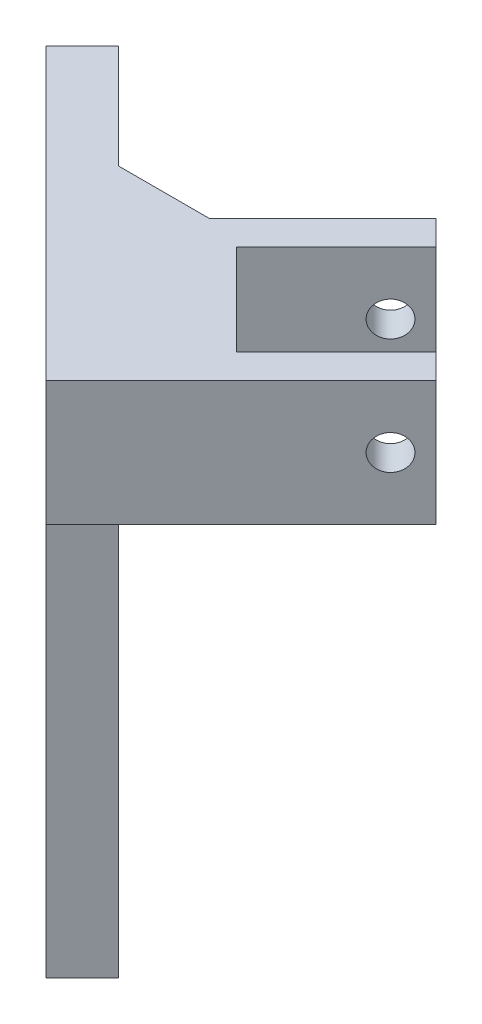
ISO-10303-21;
HEADER;
FILE_DESCRIPTION(('STEP AP214'),'2;1');
FILE_NAME('part.step','',(''),(''),'','','');
FILE_SCHEMA(('AUTOMOTIVE_DESIGN { 1 0 10303 214 1 1 1 1 }'));
ENDSEC;
DATA;
#1=APPLICATION_CONTEXT('core data for automotive mechanical design processes');
#2=APPLICATION_PROTOCOL_DEFINITION('international standard','automotive_design',2000,#1);
#3=PRODUCT_CONTEXT('',#1,'mechanical');
#4=PRODUCT('Part','Part','',(#3));
#5=PRODUCT_RELATED_PRODUCT_CATEGORY('part','',(#4));
#6=PRODUCT_DEFINITION_FORMATION('','',#4);
#7=PRODUCT_DEFINITION_CONTEXT('part definition',#1,'design');
#8=PRODUCT_DEFINITION('design','',#6,#7);
#9=PRODUCT_DEFINITION_SHAPE('','',#8);
#10=(LENGTH_UNIT() NAMED_UNIT(*) SI_UNIT(.MILLI.,.METRE.));
#11=(NAMED_UNIT(*) PLANE_ANGLE_UNIT() SI_UNIT($,.RADIAN.));
#12=(NAMED_UNIT(*) SI_UNIT($,.STERADIAN.) SOLID_ANGLE_UNIT());
#13=UNCERTAINTY_MEASURE_WITH_UNIT(LENGTH_MEASURE(1.E-05),#10,'distance_accuracy_value','');
#14=(GEOMETRIC_REPRESENTATION_CONTEXT(3) GLOBAL_UNCERTAINTY_ASSIGNED_CONTEXT((#13)) GLOBAL_UNIT_ASSIGNED_CONTEXT((#10,
#11,#12)) REPRESENTATION_CONTEXT('',''));
#15=CARTESIAN_POINT('',(0.,0.,0.));
#16=DIRECTION('',(0.,0.,1.));
#17=DIRECTION('',(1.,0.,0.));
#18=AXIS2_PLACEMENT_3D('',#15,#16,#17);
#19=CARTESIAN_POINT('',(48.0573202068203,32.8244024825225,-13.0970087257306));
#20=DIRECTION('',(0.,1.,0.));
#21=DIRECTION('',(0.,0.,1.));
#22=AXIS2_PLACEMENT_3D('',#19,#20,#21);
#23=PLANE('',#22);
#24=DIRECTION('',(0.707106781186548,0.,-0.707106781186548));
#25=VECTOR('',#24,1.);
#26=CARTESIAN_POINT('',(39.2026164109848,32.8244024825225,-21.9517125215661));
#27=LINE('',#26,#25);
#28=CARTESIAN_POINT('',(54.0518588159023,32.8244024825225,-36.8009549264837));
#29=VERTEX_POINT('',#28);
#30=CARTESIAN_POINT('',(69.6082080020064,32.8244024825225,-52.3573041125877));
#31=VERTEX_POINT('',#30);
#32=EDGE_CURVE('E306',#29,#31,#27,.T.);
#33=ORIENTED_EDGE('',*,*,#32,.F.);
#34=DIRECTION('',(-0.707106781186546,0.,-0.707106781186549));
#35=VECTOR('',#34,1.);
#36=CARTESIAN_POINT('',(62.9065626117379,32.8244024825225,-27.9462511306482));
#37=LINE('',#36,#35);
#38=CARTESIAN_POINT('',(68.1939944396333,32.8244024825225,-22.6588193027527));
#39=VERTEX_POINT('',#38);
#40=EDGE_CURVE('E308',#39,#29,#37,.T.);
#41=ORIENTED_EDGE('',*,*,#40,.F.);
#42=DIRECTION('',(-0.707106781186548,0.,0.707106781186547));
#43=VECTOR('',#42,1.);
#44=CARTESIAN_POINT('',(53.3447520347157,32.8244024825225,-7.8095768978352));
#45=LINE('',#44,#43);
#46=CARTESIAN_POINT('',(83.7503436257373,32.8244024825225,-38.2151684888568));
#47=VERTEX_POINT('',#46);
#48=EDGE_CURVE('E303',#47,#39,#45,.T.);
#49=ORIENTED_EDGE('',*,*,#48,.F.);
#50=DIRECTION('',(-0.707106781186547,0.,-0.707106781186548));
#51=VECTOR('',#50,1.);
#52=CARTESIAN_POINT('',(87.6464094306317,32.8244024825225,-34.3191026839623));
#53=LINE('',#52,#51);
#54=CARTESIAN_POINT('',(87.6464094306317,32.8244024825225,-34.3191026839623));
#55=VERTEX_POINT('',#54);
#56=EDGE_CURVE('E322',#55,#47,#53,.T.);
#57=ORIENTED_EDGE('',*,*,#56,.F.);
#58=DIRECTION('',(0.707106781186548,0.,-0.707106781186547));
#59=VECTOR('',#58,1.);
#60=CARTESIAN_POINT('',(57.2408178396102,32.8244024825225,-3.91351109294075));
#61=LINE('',#60,#59);
#62=CARTESIAN_POINT('',(57.2408178396102,32.8244024825225,-3.91351109294075));
#63=VERTEX_POINT('',#62);
#64=EDGE_CURVE('E394',#63,#55,#61,.T.);
#65=ORIENTED_EDGE('',*,*,#64,.F.);
#66=DIRECTION('',(0.707106781186548,0.,0.707106781186547));
#67=VECTOR('',#66,1.);
#68=CARTESIAN_POINT('',(48.0573202068203,32.8244024825225,-13.0970087257306));
#69=LINE('',#68,#67);
#70=CARTESIAN_POINT('',(48.0573202068203,32.8244024825225,-13.0970087257306));
#71=VERTEX_POINT('',#70);
#72=EDGE_CURVE('E348',#71,#63,#69,.T.);
#73=ORIENTED_EDGE('',*,*,#72,.F.);
#74=DIRECTION('',(0.707106781186548,0.,-0.707106781186547));
#75=VECTOR('',#74,1.);
#76=CARTESIAN_POINT('',(48.0573202068203,32.8244024825225,-13.0970087257306));
#77=LINE('',#76,#75);
#78=CARTESIAN_POINT('',(53.7141744563127,32.8244024825225,-18.7538629752231));
#79=VERTEX_POINT('',#78);
#80=EDGE_CURVE('E396',#71,#79,#77,.T.);
#81=ORIENTED_EDGE('',*,*,#80,.T.);
#82=DIRECTION('',(0.707106781186547,0.,0.707106781186548));
#83=VECTOR('',#82,1.);
#84=CARTESIAN_POINT('',(36.2340187157679,32.8244024825225,-36.2340187157678));
#85=LINE('',#84,#83);
#86=CARTESIAN_POINT('',(45.4175163485578,32.8244024825225,-27.050521082978));
#87=VERTEX_POINT('',#86);
#88=EDGE_CURVE('E412',#87,#79,#85,.T.);
#89=ORIENTED_EDGE('',*,*,#88,.F.);
#90=DIRECTION('',(0.707106781186548,0.,-0.707106781186547));
#91=VECTOR('',#90,1.);
#92=CARTESIAN_POINT('',(39.7606620990653,32.8244024825225,-21.3936668334856));
#93=LINE('',#92,#91);
#94=CARTESIAN_POINT('',(39.7606620990653,32.8244024825225,-21.3936668334856));
#95=VERTEX_POINT('',#94);
#96=EDGE_CURVE('E405',#95,#87,#93,.T.);
#97=ORIENTED_EDGE('',*,*,#96,.F.);
#98=DIRECTION('',(0.707106781186547,0.,0.707106781186548));
#99=VECTOR('',#98,1.);
#100=CARTESIAN_POINT('',(30.5771644662755,32.8244024825225,-30.5771644662755));
#101=LINE('',#100,#99);
#102=CARTESIAN_POINT('',(30.5771644662755,32.8244024825225,-30.5771644662755));
#103=VERTEX_POINT('',#102);
#104=EDGE_CURVE('E340',#103,#95,#101,.T.);
#105=ORIENTED_EDGE('',*,*,#104,.F.);
#106=DIRECTION('',(0.707106781186548,0.,-0.707106781186547));
#107=VECTOR('',#106,1.);
#108=CARTESIAN_POINT('',(30.5771644662755,32.8244024825225,-30.5771644662755));
#109=LINE('',#108,#107);
#110=CARTESIAN_POINT('',(38.5757003878185,32.8244024825225,-38.5757003878185));
#111=VERTEX_POINT('',#110);
#112=EDGE_CURVE('E50',#103,#111,#109,.T.);
#113=ORIENTED_EDGE('',*,*,#112,.T.);
#114=DIRECTION('',(1.,0.,0.));
#115=VECTOR('',#114,1.);
#116=CARTESIAN_POINT('',(48.0573202068202,32.8244024825225,-38.5757003878185));
#117=LINE('',#116,#115);
#118=CARTESIAN_POINT('',(48.0344726674483,32.8244024825225,-38.5757003878185));
#119=VERTEX_POINT('',#118);
#120=EDGE_CURVE('E11',#111,#119,#117,.T.);
#121=ORIENTED_EDGE('',*,*,#120,.T.);
#122=DIRECTION('',(-0.707106781186548,0.,0.707106781186548));
#123=VECTOR('',#122,1.);
#124=CARTESIAN_POINT('',(65.7121421971119,32.8244024825225,-56.2533699174822));
#125=LINE('',#124,#123);
#126=CARTESIAN_POINT('',(65.7121421971119,32.8244024825225,-56.2533699174822));
#127=VERTEX_POINT('',#126);
#128=EDGE_CURVE('E330',#127,#119,#125,.T.);
#129=ORIENTED_EDGE('',*,*,#128,.F.);
#130=EDGE_CURVE('E321',#31,#127,#53,.T.);
#131=ORIENTED_EDGE('',*,*,#130,.F.);
#132=EDGE_LOOP('',(#33,#41,#49,#57,#65,#73,#81,#89,#97,#105,#113,#121,#129,#131));
#133=FACE_BOUND('',#132,.T.);
#134=ADVANCED_FACE('F35',(#133),#23,.F.);
#135=CARTESIAN_POINT('',(12.0048651078897,52.2462761201849,-49.1494638246612));
#136=DIRECTION('',(0.,-1.,0.));
#137=DIRECTION('',(0.,0.,-1.));
#138=AXIS2_PLACEMENT_3D('',#135,#136,#137);
#139=PLANE('',#138);
#140=DIRECTION('',(0.707106781186548,0.,-0.707106781186548));
#141=VECTOR('',#140,1.);
#142=CARTESIAN_POINT('',(54.0518588159023,52.2462761201849,-36.8009549264837));
#143=LINE('',#142,#141);
#144=CARTESIAN_POINT('',(54.0518588159023,52.2462761201849,-36.8009549264837));
#145=VERTEX_POINT('',#144);
#146=CARTESIAN_POINT('',(69.6082080020064,52.2462761201849,-52.3573041125877));
#147=VERTEX_POINT('',#146);
#148=EDGE_CURVE('E287',#145,#147,#143,.T.);
#149=ORIENTED_EDGE('',*,*,#148,.T.);
#150=DIRECTION('',(0.707106781186548,0.,0.707106781186548));
#151=VECTOR('',#150,1.);
#152=CARTESIAN_POINT('',(65.7121421971119,52.246276120185,-56.2533699174822));
#153=LINE('',#152,#151);
#154=CARTESIAN_POINT('',(65.7121421971119,52.246276120185,-56.2533699174822));
#155=VERTEX_POINT('',#154);
#156=EDGE_CURVE('E314',#155,#147,#153,.T.);
#157=ORIENTED_EDGE('',*,*,#156,.F.);
#158=DIRECTION('',(-0.707106781186548,0.,0.707106781186548));
#159=VECTOR('',#158,1.);
#160=CARTESIAN_POINT('',(65.7121421971119,52.246276120185,-56.2533699174822));
#161=LINE('',#160,#159);
#162=CARTESIAN_POINT('',(48.0344726674483,52.246276120185,-38.5757003878185));
#163=VERTEX_POINT('',#162);
#164=EDGE_CURVE('E327',#155,#163,#161,.T.);
#165=ORIENTED_EDGE('',*,*,#164,.T.);
#166=DIRECTION('',(-1.,0.,0.));
#167=VECTOR('',#166,1.);
#168=CARTESIAN_POINT('',(12.0048651078898,52.2462761201849,-38.5757003878184));
#169=LINE('',#168,#167);
#170=CARTESIAN_POINT('',(33.8923370437172,52.2462761201849,-38.5757003878185));
#171=VERTEX_POINT('',#170);
#172=EDGE_CURVE('E424',#163,#171,#169,.T.);
#173=ORIENTED_EDGE('',*,*,#172,.T.);
#174=DIRECTION('',(-0.707106781186547,0.,-0.707106781186548));
#175=VECTOR('',#174,1.);
#176=CARTESIAN_POINT('',(17.6617193573821,52.2462761201849,-54.8063180741536));
#177=LINE('',#176,#175);
#178=CARTESIAN_POINT('',(17.6617193573821,52.2462761201849,-54.8063180741536));
#179=VERTEX_POINT('',#178);
#180=EDGE_CURVE('E372',#171,#179,#177,.T.);
#181=ORIENTED_EDGE('',*,*,#180,.T.);
#182=DIRECTION('',(0.707106781186548,0.,-0.707106781186547));
#183=VECTOR('',#182,1.);
#184=CARTESIAN_POINT('',(12.0048651078897,52.2462761201849,-49.1494638246612));
#185=LINE('',#184,#183);
#186=CARTESIAN_POINT('',(12.0048651078897,52.2462761201849,-49.1494638246612));
#187=VERTEX_POINT('',#186);
#188=EDGE_CURVE('E388',#187,#179,#185,.T.);
#189=ORIENTED_EDGE('',*,*,#188,.F.);
#190=DIRECTION('',(-0.707106781186547,0.,-0.707106781186548));
#191=VECTOR('',#190,1.);
#192=CARTESIAN_POINT('',(12.0048651078897,52.2462761201849,-49.1494638246612));
#193=LINE('',#192,#191);
#194=CARTESIAN_POINT('',(57.2408178396102,52.2462761201849,-3.91351109294075));
#195=VERTEX_POINT('',#194);
#196=EDGE_CURVE('E352',#195,#187,#193,.T.);
#197=ORIENTED_EDGE('',*,*,#196,.F.);
#198=DIRECTION('',(0.707106781186548,0.,-0.707106781186547));
#199=VECTOR('',#198,1.);
#200=CARTESIAN_POINT('',(57.2408178396102,52.2462761201849,-3.91351109294075));
#201=LINE('',#200,#199);
#202=CARTESIAN_POINT('',(87.6464094306318,52.2462761201849,-34.3191026839623));
#203=VERTEX_POINT('',#202);
#204=EDGE_CURVE('E391',#195,#203,#201,.T.);
#205=ORIENTED_EDGE('',*,*,#204,.T.);
#206=CARTESIAN_POINT('',(83.7503436257373,52.2462761201849,-38.2151684888568));
#207=VERTEX_POINT('',#206);
#208=EDGE_CURVE('E318',#207,#203,#153,.T.);
#209=ORIENTED_EDGE('',*,*,#208,.F.);
#210=DIRECTION('',(-0.707106781186548,0.,0.707106781186547));
#211=VECTOR('',#210,1.);
#212=CARTESIAN_POINT('',(83.7503436257373,52.2462761201849,-38.2151684888568));
#213=LINE('',#212,#211);
#214=CARTESIAN_POINT('',(68.1939944396333,52.2462761201849,-22.6588193027527));
#215=VERTEX_POINT('',#214);
#216=EDGE_CURVE('E290',#207,#215,#213,.T.);
#217=ORIENTED_EDGE('',*,*,#216,.T.);
#218=DIRECTION('',(-0.707106781186546,0.,-0.707106781186549));
#219=VECTOR('',#218,1.);
#220=CARTESIAN_POINT('',(68.1939944396333,52.2462761201849,-22.6588193027527));
#221=LINE('',#220,#219);
#222=EDGE_CURVE('E284',#215,#145,#221,.T.);
#223=ORIENTED_EDGE('',*,*,#222,.T.);
#224=EDGE_LOOP('',(#149,#157,#165,#173,#181,#189,#197,#205,#209,#217,#223));
#225=FACE_BOUND('',#224,.T.);
#226=ADVANCED_FACE('F505',(#225),#139,.F.);
#227=CARTESIAN_POINT('',(60.982756057297,0.,-60.982756057297));
#228=DIRECTION('',(0.707106781186548,0.,-0.707106781186548));
#229=DIRECTION('',(-0.707106781186548,0.,-0.707106781186548));
#230=AXIS2_PLACEMENT_3D('',#227,#228,#229);
#231=PLANE('',#230);
#232=ORIENTED_EDGE('',*,*,#156,.T.);
#233=DIRECTION('',(0.,1.,0.));
#234=VECTOR('',#233,1.);
#235=CARTESIAN_POINT('',(69.6082080020064,27.2462761201849,-52.3573041125877));
#236=LINE('',#235,#234);
#237=EDGE_CURVE('E298',#31,#147,#236,.T.);
#238=ORIENTED_EDGE('',*,*,#237,.F.);
#239=ORIENTED_EDGE('',*,*,#130,.T.);
#240=DIRECTION('',(0.,1.,0.));
#241=VECTOR('',#240,1.);
#242=CARTESIAN_POINT('',(65.7121421971119,32.8244024825225,-56.2533699174822));
#243=LINE('',#242,#241);
#244=EDGE_CURVE('E325',#127,#155,#243,.T.);
#245=ORIENTED_EDGE('',*,*,#244,.T.);
#246=EDGE_LOOP('',(#232,#238,#239,#245));
#247=FACE_BOUND('',#246,.T.);
#248=ADVANCED_FACE('F440',(#247),#231,.T.);
#249=ORIENTED_EDGE('',*,*,#56,.T.);
#250=DIRECTION('',(0.,1.,0.));
#251=VECTOR('',#250,1.);
#252=CARTESIAN_POINT('',(83.7503436257373,27.2462761201849,-38.2151684888568));
#253=LINE('',#252,#251);
#254=EDGE_CURVE('E295',#47,#207,#253,.T.);
#255=ORIENTED_EDGE('',*,*,#254,.T.);
#256=ORIENTED_EDGE('',*,*,#208,.T.);
#257=DIRECTION('',(0.,-1.,0.));
#258=VECTOR('',#257,1.);
#259=CARTESIAN_POINT('',(87.6464094306318,52.2462761201849,-34.3191026839623));
#260=LINE('',#259,#258);
#261=EDGE_CURVE('E317',#203,#55,#260,.T.);
#262=ORIENTED_EDGE('',*,*,#261,.T.);
#263=EDGE_LOOP('',(#249,#255,#256,#262));
#264=FACE_BOUND('',#263,.T.);
#265=ADVANCED_FACE('F457',(#264),#231,.T.);
#266=CARTESIAN_POINT('',(52.2910703713043,42.5353393013537,-62.6033739314242));
#267=DIRECTION('',(0.707106781186547,0.,0.707106781186547));
#268=DIRECTION('',(0.707106781186548,0.,-0.707106781186548));
#269=AXIS2_PLACEMENT_3D('',#266,#267,#268);
#270=CYLINDRICAL_SURFACE('',#269,2.7);
#271=CARTESIAN_POINT('',(62.1766082911791,42.5353393013537,-52.7178360115494));
#272=DIRECTION('',(0.707106781186548,0.,0.707106781186548));
#273=DIRECTION('',(0.707106781186548,0.,-0.707106781186548));
#274=AXIS2_PLACEMENT_3D('',#271,#272,#273);
#275=CIRCLE('',#274,2.7);
#276=CARTESIAN_POINT('',(64.0857966003828,42.5353393013537,-54.6270243207531));
#277=VERTEX_POINT('',#276);
#278=EDGE_CURVE('E313',#277,#277,#275,.T.);
#279=ORIENTED_EDGE('',*,*,#278,.F.);
#280=EDGE_LOOP('',(#279));
#281=FACE_BOUND('',#280,.T.);
#282=CARTESIAN_POINT('',(66.0726740960736,42.5353393013537,-48.8217702066549));
#283=DIRECTION('',(0.707106781186548,0.,0.707106781186548));
#284=DIRECTION('',(0.707106781186548,0.,-0.707106781186548));
#285=AXIS2_PLACEMENT_3D('',#282,#283,#284);
#286=CIRCLE('',#285,2.7);
#287=CARTESIAN_POINT('',(67.9818624052772,42.5353393013537,-50.7309585158586));
#288=VERTEX_POINT('',#287);
#289=EDGE_CURVE('E305',#288,#288,#286,.F.);
#290=ORIENTED_EDGE('',*,*,#289,.F.);
#291=EDGE_LOOP('',(#290));
#292=FACE_BOUND('',#291,.T.);
#293=ADVANCED_FACE('F601',(#281,#292),#270,.F.);
#294=CARTESIAN_POINT('',(84.110875524699,42.5353393013537,-30.7835687780295));
#295=DIRECTION('',(0.707106781186548,0.,0.707106781186548));
#296=DIRECTION('',(0.707106781186548,0.,-0.707106781186548));
#297=AXIS2_PLACEMENT_3D('',#294,#295,#296);
#298=CIRCLE('',#297,2.7);
#299=CARTESIAN_POINT('',(86.0200638339026,42.5353393013537,-32.6927570872332));
#300=VERTEX_POINT('',#299);
#301=EDGE_CURVE('E310',#300,#300,#298,.T.);
#302=ORIENTED_EDGE('',*,*,#301,.T.);
#303=EDGE_LOOP('',(#302));
#304=FACE_BOUND('',#303,.T.);
#305=CARTESIAN_POINT('',(80.2148097198045,42.5353393013537,-34.679634582924));
#306=DIRECTION('',(-0.707106781186547,0.,-0.707106781186548));
#307=DIRECTION('',(-0.707106781186548,0.,0.707106781186547));
#308=AXIS2_PLACEMENT_3D('',#305,#306,#307);
#309=CIRCLE('',#308,2.7);
#310=CARTESIAN_POINT('',(78.3056214106008,42.5353393013537,-32.7704462737203));
#311=VERTEX_POINT('',#310);
#312=EDGE_CURVE('E302',#311,#311,#309,.F.);
#313=ORIENTED_EDGE('',*,*,#312,.F.);
#314=EDGE_LOOP('',(#313));
#315=FACE_BOUND('',#314,.T.);
#316=ADVANCED_FACE('F538',(#304,#315),#270,.F.);
#317=CARTESIAN_POINT('',(36.2340187157679,0.,-36.2340187157678));
#318=DIRECTION('',(0.707106781186548,0.,-0.707106781186547));
#319=DIRECTION('',(-0.707106781186547,0.,-0.707106781186548));
#320=AXIS2_PLACEMENT_3D('',#317,#318,#319);
#321=PLANE('',#320);
#322=DIRECTION('',(0.,-1.,0.));
#323=VECTOR('',#322,1.);
#324=CARTESIAN_POINT('',(45.4175163485577,32.8244024825225,-27.050521082978));
#325=LINE('',#324,#323);
#326=CARTESIAN_POINT('',(45.4175163485577,-37.673114458677,-27.050521082978));
#327=VERTEX_POINT('',#326);
#328=EDGE_CURVE('E365',#87,#327,#325,.T.);
#329=ORIENTED_EDGE('',*,*,#328,.F.);
#330=ORIENTED_EDGE('',*,*,#88,.T.);
#331=DIRECTION('',(0.,1.,0.));
#332=VECTOR('',#331,1.);
#333=CARTESIAN_POINT('',(53.7141744563127,32.8244024825225,-18.753862975223));
#334=LINE('',#333,#332);
#335=CARTESIAN_POINT('',(53.7141744563127,-37.673114458677,-18.753862975223));
#336=VERTEX_POINT('',#335);
#337=EDGE_CURVE('E369',#336,#79,#334,.T.);
#338=ORIENTED_EDGE('',*,*,#337,.F.);
#339=DIRECTION('',(0.707106781186547,0.,0.707106781186548));
#340=VECTOR('',#339,1.);
#341=CARTESIAN_POINT('',(53.7141744563127,-37.673114458677,-18.753862975223));
#342=LINE('',#341,#340);
#343=EDGE_CURVE('E367',#327,#336,#342,.T.);
#344=ORIENTED_EDGE('',*,*,#343,.F.);
#345=EDGE_LOOP('',(#329,#330,#338,#344));
#346=FACE_BOUND('',#345,.T.);
#347=ADVANCED_FACE('F477',(#346),#321,.T.);
#348=CARTESIAN_POINT('',(23.4329498753639,-47.930290182876,-49.0350875561718));
#349=DIRECTION('',(0.707106781186548,0.,-0.707106781186547));
#350=DIRECTION('',(-0.707106781186547,0.,-0.707106781186548));
#351=AXIS2_PLACEMENT_3D('',#348,#349,#350);
#352=CIRCLE('',#351,1.85000000000001);
#353=CARTESIAN_POINT('',(24.7410974205591,-47.930290182876,-47.7269400109767));
#354=VERTEX_POINT('',#353);
#355=CARTESIAN_POINT('',(22.1248023301688,-47.930290182876,-50.3432351013669));
#356=VERTEX_POINT('',#355);
#357=EDGE_CURVE('E223',#354,#356,#352,.T.);
#358=ORIENTED_EDGE('',*,*,#357,.F.);
#359=DIRECTION('',(0.,-1.,0.));
#360=VECTOR('',#359,1.);
#361=CARTESIAN_POINT('',(24.7410974205591,0.,-47.7269400109767));
#362=LINE('',#361,#360);
#363=CARTESIAN_POINT('',(24.7410974205591,32.069709817124,-47.7269400109767));
#364=VERTEX_POINT('',#363);
#365=EDGE_CURVE('E276',#364,#354,#362,.T.);
#366=ORIENTED_EDGE('',*,*,#365,.F.);
#367=CARTESIAN_POINT('',(23.4329498753639,32.069709817124,-49.0350875561718));
#368=DIRECTION('',(0.707106781186548,0.,-0.707106781186547));
#369=DIRECTION('',(-0.707106781186547,0.,-0.707106781186548));
#370=AXIS2_PLACEMENT_3D('',#367,#368,#369);
#371=CIRCLE('',#370,1.84999999999999);
#372=CARTESIAN_POINT('',(22.1248023301688,32.069709817124,-50.3432351013669));
#373=VERTEX_POINT('',#372);
#374=EDGE_CURVE('E278',#373,#364,#371,.T.);
#375=ORIENTED_EDGE('',*,*,#374,.F.);
#376=DIRECTION('',(0.,-1.,0.));
#377=VECTOR('',#376,1.);
#378=CARTESIAN_POINT('',(22.1248023301688,0.,-50.3432351013669));
#379=LINE('',#378,#377);
#380=EDGE_CURVE('E281',#373,#356,#379,.T.);
#381=ORIENTED_EDGE('',*,*,#380,.T.);
#382=EDGE_LOOP('',(#358,#366,#375,#381));
#383=FACE_BOUND('',#382,.T.);
#384=DIRECTION('',(0.,-1.,0.));
#385=VECTOR('',#384,1.);
#386=CARTESIAN_POINT('',(15.0537345183034,0.,-57.4143029132324));
#387=LINE('',#386,#385);
#388=CARTESIAN_POINT('',(15.0537345183033,32.069709817124,-57.4143029132324));
#389=VERTEX_POINT('',#388);
#390=CARTESIAN_POINT('',(15.0537345183034,-47.930290182876,-57.4143029132324));
#391=VERTEX_POINT('',#390);
#392=EDGE_CURVE('E274',#389,#391,#387,.T.);
#393=ORIENTED_EDGE('',*,*,#392,.F.);
#394=CARTESIAN_POINT('',(13.7455869731083,32.069709817124,-58.7224504584275));
#395=DIRECTION('',(0.707106781186548,0.,-0.707106781186547));
#396=DIRECTION('',(-0.707106781186547,0.,-0.707106781186548));
#397=AXIS2_PLACEMENT_3D('',#394,#395,#396);
#398=CIRCLE('',#397,1.85);
#399=CARTESIAN_POINT('',(12.4374394279131,32.069709817124,-60.0305980036226));
#400=VERTEX_POINT('',#399);
#401=EDGE_CURVE('E261',#400,#389,#398,.T.);
#402=ORIENTED_EDGE('',*,*,#401,.F.);
#403=DIRECTION('',(0.,-1.,0.));
#404=VECTOR('',#403,1.);
#405=CARTESIAN_POINT('',(12.4374394279131,0.,-60.0305980036226));
#406=LINE('',#405,#404);
#407=CARTESIAN_POINT('',(12.4374394279131,-47.930290182876,-60.0305980036226));
#408=VERTEX_POINT('',#407);
#409=EDGE_CURVE('E269',#400,#408,#406,.T.);
#410=ORIENTED_EDGE('',*,*,#409,.T.);
#411=CARTESIAN_POINT('',(13.7455869731083,-47.930290182876,-58.7224504584275));
#412=DIRECTION('',(0.707106781186548,0.,-0.707106781186547));
#413=DIRECTION('',(-0.707106781186547,0.,-0.707106781186548));
#414=AXIS2_PLACEMENT_3D('',#411,#412,#413);
#415=CIRCLE('',#414,1.85000000000001);
#416=EDGE_CURVE('E272',#391,#408,#415,.T.);
#417=ORIENTED_EDGE('',*,*,#416,.F.);
#418=EDGE_LOOP('',(#393,#402,#410,#417));
#419=FACE_BOUND('',#418,.T.);
#420=ORIENTED_EDGE('',*,*,#180,.F.);
#421=DIRECTION('',(0.,-1.,0.));
#422=VECTOR('',#421,1.);
#423=CARTESIAN_POINT('',(33.8923370437172,0.,-38.5757003878185));
#424=LINE('',#423,#422);
#425=CARTESIAN_POINT('',(33.8923370437172,29.512764503148,-38.5757003878185));
#426=VERTEX_POINT('',#425);
#427=EDGE_CURVE('E58',#171,#426,#424,.T.);
#428=ORIENTED_EDGE('',*,*,#427,.T.);
#429=DIRECTION('',(0.500000000000001,0.707106781186546,0.500000000000001));
#430=VECTOR('',#429,1.);
#431=CARTESIAN_POINT('',(29.6476239728475,23.5098337099417,-42.8204134586882));
#432=LINE('',#431,#430);
#433=CARTESIAN_POINT('',(29.6476239728475,23.5098337099417,-42.8204134586882));
#434=VERTEX_POINT('',#433);
#435=EDGE_CURVE('E363',#434,#426,#432,.T.);
#436=ORIENTED_EDGE('',*,*,#435,.F.);
#437=DIRECTION('',(0.,1.,0.));
#438=VECTOR('',#437,1.);
#439=CARTESIAN_POINT('',(29.6476239728475,-53.2202506721997,-42.8204134586882));
#440=LINE('',#439,#438);
#441=CARTESIAN_POINT('',(29.6476239728475,-53.2202506721997,-42.8204134586882));
#442=VERTEX_POINT('',#441);
#443=EDGE_CURVE('E333',#442,#434,#440,.T.);
#444=ORIENTED_EDGE('',*,*,#443,.F.);
#445=DIRECTION('',(0.707106781186547,0.,0.707106781186547));
#446=VECTOR('',#445,1.);
#447=CARTESIAN_POINT('',(7.5309128756247,-53.2202506721997,-64.937124555911));
#448=LINE('',#447,#446);
#449=CARTESIAN_POINT('',(7.5309128756247,-53.2202506721997,-64.937124555911));
#450=VERTEX_POINT('',#449);
#451=EDGE_CURVE('E338',#450,#442,#448,.T.);
#452=ORIENTED_EDGE('',*,*,#451,.F.);
#453=DIRECTION('',(0.,-1.,0.));
#454=VECTOR('',#453,1.);
#455=CARTESIAN_POINT('',(7.5309128756247,32.8244024825225,-64.937124555911));
#456=LINE('',#455,#454);
#457=CARTESIAN_POINT('',(7.5309128756247,37.9191521959063,-64.937124555911));
#458=VERTEX_POINT('',#457);
#459=EDGE_CURVE('E377',#458,#450,#456,.T.);
#460=ORIENTED_EDGE('',*,*,#459,.F.);
#461=DIRECTION('',(-0.500000000000001,-0.707106781186546,-0.500000000000001));
#462=VECTOR('',#461,1.);
#463=CARTESIAN_POINT('',(7.5309128756247,37.9191521959063,-64.937124555911));
#464=LINE('',#463,#462);
#465=EDGE_CURVE('E374',#179,#458,#464,.T.);
#466=ORIENTED_EDGE('',*,*,#465,.F.);
#467=EDGE_LOOP('',(#420,#428,#436,#444,#452,#460,#466));
#468=FACE_BOUND('',#467,.T.);
#469=ADVANCED_FACE('F490',(#383,#419,#468),#321,.T.);
#470=CARTESIAN_POINT('',(23.9907697233551,-53.2202506721997,-37.1635592091958));
#471=DIRECTION('',(-0.707106781186547,0.,-0.707106781186548));
#472=DIRECTION('',(-0.707106781186548,0.,0.707106781186547));
#473=AXIS2_PLACEMENT_3D('',#470,#471,#472);
#474=PLANE('',#473);
#475=ORIENTED_EDGE('',*,*,#443,.T.);
#476=DIRECTION('',(0.707106781186548,0.,-0.707106781186547));
#477=VECTOR('',#476,1.);
#478=CARTESIAN_POINT('',(23.9907697233551,23.5098337099417,-37.1635592091958));
#479=LINE('',#478,#477);
#480=CARTESIAN_POINT('',(23.9907697233551,23.5098337099417,-37.1635592091958));
#481=VERTEX_POINT('',#480);
#482=EDGE_CURVE('E409',#481,#434,#479,.T.);
#483=ORIENTED_EDGE('',*,*,#482,.F.);
#484=DIRECTION('',(0.,1.,0.));
#485=VECTOR('',#484,1.);
#486=CARTESIAN_POINT('',(23.9907697233551,-53.2202506721997,-37.1635592091958));
#487=LINE('',#486,#485);
#488=CARTESIAN_POINT('',(23.9907697233551,-53.2202506721997,-37.1635592091958));
#489=VERTEX_POINT('',#488);
#490=EDGE_CURVE('E334',#489,#481,#487,.T.);
#491=ORIENTED_EDGE('',*,*,#490,.F.);
#492=DIRECTION('',(0.707106781186548,0.,-0.707106781186547));
#493=VECTOR('',#492,1.);
#494=CARTESIAN_POINT('',(23.9907697233551,-53.2202506721997,-37.1635592091958));
#495=LINE('',#494,#493);
#496=EDGE_CURVE('E360',#489,#442,#495,.T.);
#497=ORIENTED_EDGE('',*,*,#496,.T.);
#498=EDGE_LOOP('',(#475,#483,#491,#497));
#499=FACE_BOUND('',#498,.T.);
#500=ADVANCED_FACE('F487',(#499),#474,.F.);
#501=CARTESIAN_POINT('',(23.9907697233551,23.5098337099417,-37.1635592091958));
#502=DIRECTION('',(-0.499999999999999,0.707106781186549,-0.499999999999999));
#503=DIRECTION('',(0.,0.577350269189624,0.816496580927727));
#504=AXIS2_PLACEMENT_3D('',#501,#502,#503);
#505=PLANE('',#504);
#506=ORIENTED_EDGE('',*,*,#435,.T.);
#507=DIRECTION('',(0.816496580927729,0.577350269189622,0.));
#508=VECTOR('',#507,1.);
#509=CARTESIAN_POINT('',(24.4614834495626,22.8441439743438,-38.5757003878184));
#510=LINE('',#509,#508);
#511=EDGE_CURVE('E44',#426,#111,#510,.T.);
#512=ORIENTED_EDGE('',*,*,#511,.T.);
#513=ORIENTED_EDGE('',*,*,#112,.F.);
#514=DIRECTION('',(0.500000000000001,0.707106781186546,0.500000000000001));
#515=VECTOR('',#514,1.);
#516=CARTESIAN_POINT('',(23.9907697233551,23.5098337099417,-37.1635592091958));
#517=LINE('',#516,#515);
#518=EDGE_CURVE('E337',#481,#103,#517,.T.);
#519=ORIENTED_EDGE('',*,*,#518,.F.);
#520=ORIENTED_EDGE('',*,*,#482,.T.);
#521=EDGE_LOOP('',(#506,#512,#513,#519,#520));
#522=FACE_BOUND('',#521,.T.);
#523=ADVANCED_FACE('F428',(#522),#505,.F.);
#524=CARTESIAN_POINT('',(39.7606620990653,32.8244024825225,-21.3936668334856));
#525=DIRECTION('',(0.707106781186547,0.,0.707106781186548));
#526=DIRECTION('',(0.707106781186548,0.,-0.707106781186547));
#527=AXIS2_PLACEMENT_3D('',#524,#525,#526);
#528=PLANE('',#527);
#529=ORIENTED_EDGE('',*,*,#328,.T.);
#530=DIRECTION('',(0.707106781186548,0.,-0.707106781186547));
#531=VECTOR('',#530,1.);
#532=CARTESIAN_POINT('',(39.7606620990653,-37.673114458677,-21.3936668334856));
#533=LINE('',#532,#531);
#534=CARTESIAN_POINT('',(39.7606620990653,-37.673114458677,-21.3936668334856));
#535=VERTEX_POINT('',#534);
#536=EDGE_CURVE('E402',#535,#327,#533,.T.);
#537=ORIENTED_EDGE('',*,*,#536,.F.);
#538=DIRECTION('',(0.,-1.,0.));
#539=VECTOR('',#538,1.);
#540=CARTESIAN_POINT('',(39.7606620990653,32.8244024825225,-21.3936668334856));
#541=LINE('',#540,#539);
#542=EDGE_CURVE('E342',#95,#535,#541,.T.);
#543=ORIENTED_EDGE('',*,*,#542,.F.);
#544=ORIENTED_EDGE('',*,*,#96,.T.);
#545=EDGE_LOOP('',(#529,#537,#543,#544));
#546=FACE_BOUND('',#545,.T.);
#547=ADVANCED_FACE('F481',(#546),#528,.F.);
#548=CARTESIAN_POINT('',(48.0573202068203,-37.673114458677,-13.0970087257306));
#549=DIRECTION('',(0.,1.,0.));
#550=DIRECTION('',(0.,0.,1.));
#551=AXIS2_PLACEMENT_3D('',#548,#549,#550);
#552=PLANE('',#551);
#553=ORIENTED_EDGE('',*,*,#343,.T.);
#554=DIRECTION('',(0.707106781186548,0.,-0.707106781186547));
#555=VECTOR('',#554,1.);
#556=CARTESIAN_POINT('',(48.0573202068203,-37.673114458677,-13.0970087257306));
#557=LINE('',#556,#555);
#558=CARTESIAN_POINT('',(48.0573202068203,-37.673114458677,-13.0970087257306));
#559=VERTEX_POINT('',#558);
#560=EDGE_CURVE('E399',#559,#336,#557,.T.);
#561=ORIENTED_EDGE('',*,*,#560,.F.);
#562=DIRECTION('',(0.707106781186547,0.,0.707106781186548));
#563=VECTOR('',#562,1.);
#564=CARTESIAN_POINT('',(48.0573202068203,-37.673114458677,-13.0970087257306));
#565=LINE('',#564,#563);
#566=EDGE_CURVE('E344',#535,#559,#565,.T.);
#567=ORIENTED_EDGE('',*,*,#566,.F.);
#568=ORIENTED_EDGE('',*,*,#536,.T.);
#569=EDGE_LOOP('',(#553,#561,#567,#568));
#570=FACE_BOUND('',#569,.T.);
#571=ADVANCED_FACE('F522',(#570),#552,.F.);
#572=CARTESIAN_POINT('',(48.0573202068203,32.8244024825225,-13.0970087257306));
#573=DIRECTION('',(-0.707106781186547,0.,-0.707106781186548));
#574=DIRECTION('',(-0.707106781186548,0.,0.707106781186547));
#575=AXIS2_PLACEMENT_3D('',#572,#573,#574);
#576=PLANE('',#575);
#577=ORIENTED_EDGE('',*,*,#337,.T.);
#578=ORIENTED_EDGE('',*,*,#80,.F.);
#579=DIRECTION('',(0.,1.,0.));
#580=VECTOR('',#579,1.);
#581=CARTESIAN_POINT('',(48.0573202068203,32.8244024825225,-13.0970087257306));
#582=LINE('',#581,#580);
#583=EDGE_CURVE('E346',#559,#71,#582,.T.);
#584=ORIENTED_EDGE('',*,*,#583,.F.);
#585=ORIENTED_EDGE('',*,*,#560,.T.);
#586=EDGE_LOOP('',(#577,#578,#584,#585));
#587=FACE_BOUND('',#586,.T.);
#588=ADVANCED_FACE('F472',(#587),#576,.F.);
#589=CARTESIAN_POINT('',(57.2408178396102,52.2462761201849,-3.91351109294075));
#590=DIRECTION('',(-0.707106781186547,0.,-0.707106781186548));
#591=DIRECTION('',(-0.707106781186548,0.,0.707106781186547));
#592=AXIS2_PLACEMENT_3D('',#589,#590,#591);
#593=PLANE('',#592);
#594=ORIENTED_EDGE('',*,*,#301,.F.);
#595=EDGE_LOOP('',(#594));
#596=FACE_BOUND('',#595,.T.);
#597=ORIENTED_EDGE('',*,*,#64,.T.);
#598=ORIENTED_EDGE('',*,*,#261,.F.);
#599=ORIENTED_EDGE('',*,*,#204,.F.);
#600=DIRECTION('',(0.,1.,0.));
#601=VECTOR('',#600,1.);
#602=CARTESIAN_POINT('',(57.2408178396102,52.2462761201849,-3.91351109294075));
#603=LINE('',#602,#601);
#604=EDGE_CURVE('E350',#63,#195,#603,.T.);
#605=ORIENTED_EDGE('',*,*,#604,.F.);
#606=EDGE_LOOP('',(#597,#598,#599,#605));
#607=FACE_BOUND('',#606,.T.);
#608=ADVANCED_FACE('F462',(#596,#607),#593,.F.);
#609=CARTESIAN_POINT('',(1.87405862613232,37.9191521959063,-59.2802703064186));
#610=DIRECTION('',(0.499999999999999,-0.707106781186549,0.499999999999999));
#611=DIRECTION('',(0.,-0.577350269189625,-0.816496580927727));
#612=AXIS2_PLACEMENT_3D('',#609,#610,#611);
#613=PLANE('',#612);
#614=ORIENTED_EDGE('',*,*,#465,.T.);
#615=DIRECTION('',(0.707106781186548,0.,-0.707106781186547));
#616=VECTOR('',#615,1.);
#617=CARTESIAN_POINT('',(1.87405862613232,37.9191521959063,-59.2802703064186));
#618=LINE('',#617,#616);
#619=CARTESIAN_POINT('',(1.87405862613232,37.9191521959063,-59.2802703064186));
#620=VERTEX_POINT('',#619);
#621=EDGE_CURVE('E385',#620,#458,#618,.T.);
#622=ORIENTED_EDGE('',*,*,#621,.F.);
#623=DIRECTION('',(-0.500000000000001,-0.707106781186546,-0.500000000000001));
#624=VECTOR('',#623,1.);
#625=CARTESIAN_POINT('',(1.87405862613232,37.9191521959063,-59.2802703064186));
#626=LINE('',#625,#624);
#627=EDGE_CURVE('E354',#187,#620,#626,.T.);
#628=ORIENTED_EDGE('',*,*,#627,.F.);
#629=ORIENTED_EDGE('',*,*,#188,.T.);
#630=EDGE_LOOP('',(#614,#622,#628,#629));
#631=FACE_BOUND('',#630,.T.);
#632=ADVANCED_FACE('F502',(#631),#613,.F.);
#633=CARTESIAN_POINT('',(1.87405862613232,32.8244024825225,-59.2802703064186));
#634=DIRECTION('',(0.707106781186547,0.,0.707106781186548));
#635=DIRECTION('',(0.707106781186548,0.,-0.707106781186547));
#636=AXIS2_PLACEMENT_3D('',#633,#634,#635);
#637=PLANE('',#636);
#638=ORIENTED_EDGE('',*,*,#459,.T.);
#639=DIRECTION('',(0.707106781186548,0.,-0.707106781186547));
#640=VECTOR('',#639,1.);
#641=CARTESIAN_POINT('',(1.87405862613232,-53.2202506721997,-59.2802703064186));
#642=LINE('',#641,#640);
#643=CARTESIAN_POINT('',(1.87405862613232,-53.2202506721997,-59.2802703064186));
#644=VERTEX_POINT('',#643);
#645=EDGE_CURVE('E382',#644,#450,#642,.T.);
#646=ORIENTED_EDGE('',*,*,#645,.F.);
#647=DIRECTION('',(0.,-1.,0.));
#648=VECTOR('',#647,1.);
#649=CARTESIAN_POINT('',(1.87405862613232,32.8244024825225,-59.2802703064186));
#650=LINE('',#649,#648);
#651=EDGE_CURVE('E356',#620,#644,#650,.T.);
#652=ORIENTED_EDGE('',*,*,#651,.F.);
#653=ORIENTED_EDGE('',*,*,#621,.T.);
#654=EDGE_LOOP('',(#638,#646,#652,#653));
#655=FACE_BOUND('',#654,.T.);
#656=ADVANCED_FACE('F498',(#655),#637,.F.);
#657=CARTESIAN_POINT('',(1.87405862613232,-53.2202506721997,-59.2802703064186));
#658=DIRECTION('',(0.,1.,0.));
#659=DIRECTION('',(0.,0.,1.));
#660=AXIS2_PLACEMENT_3D('',#657,#658,#659);
#661=PLANE('',#660);
#662=ORIENTED_EDGE('',*,*,#451,.T.);
#663=ORIENTED_EDGE('',*,*,#496,.F.);
#664=DIRECTION('',(0.707106781186547,0.,0.707106781186547));
#665=VECTOR('',#664,1.);
#666=CARTESIAN_POINT('',(1.87405862613232,-53.2202506721997,-59.2802703064186));
#667=LINE('',#666,#665);
#668=EDGE_CURVE('E358',#644,#489,#667,.T.);
#669=ORIENTED_EDGE('',*,*,#668,.F.);
#670=ORIENTED_EDGE('',*,*,#645,.T.);
#671=EDGE_LOOP('',(#662,#663,#669,#670));
#672=FACE_BOUND('',#671,.T.);
#673=ADVANCED_FACE('F493',(#672),#661,.F.);
#674=CARTESIAN_POINT('',(30.5771644662755,0.,-30.5771644662755));
#675=DIRECTION('',(0.707106781186548,0.,-0.707106781186547));
#676=DIRECTION('',(-0.707106781186547,0.,-0.707106781186548));
#677=AXIS2_PLACEMENT_3D('',#674,#675,#676);
#678=PLANE('',#677);
#679=DIRECTION('',(0.,1.,0.));
#680=VECTOR('',#679,1.);
#681=CARTESIAN_POINT('',(19.0842431710667,-47.930290182876,-42.0700857614843));
#682=LINE('',#681,#680);
#683=CARTESIAN_POINT('',(19.0842431710667,-47.930290182876,-42.0700857614843));
#684=VERTEX_POINT('',#683);
#685=CARTESIAN_POINT('',(19.0842431710667,32.069709817124,-42.0700857614843));
#686=VERTEX_POINT('',#685);
#687=EDGE_CURVE('E242',#684,#686,#682,.T.);
#688=ORIENTED_EDGE('',*,*,#687,.F.);
#689=CARTESIAN_POINT('',(17.7760956258716,-47.930290182876,-43.3782333066794));
#690=DIRECTION('',(-0.707106781186548,0.,0.707106781186547));
#691=DIRECTION('',(0.707106781186547,0.,0.707106781186548));
#692=AXIS2_PLACEMENT_3D('',#689,#690,#691);
#693=CIRCLE('',#692,1.85000000000001);
#694=CARTESIAN_POINT('',(16.4679480806764,-47.930290182876,-44.6863808518745));
#695=VERTEX_POINT('',#694);
#696=EDGE_CURVE('E220',#695,#684,#693,.T.);
#697=ORIENTED_EDGE('',*,*,#696,.F.);
#698=DIRECTION('',(0.,1.,0.));
#699=VECTOR('',#698,1.);
#700=CARTESIAN_POINT('',(16.4679480806764,-47.930290182876,-44.6863808518745));
#701=LINE('',#700,#699);
#702=CARTESIAN_POINT('',(16.4679480806765,32.069709817124,-44.6863808518745));
#703=VERTEX_POINT('',#702);
#704=EDGE_CURVE('E229',#695,#703,#701,.T.);
#705=ORIENTED_EDGE('',*,*,#704,.T.);
#706=CARTESIAN_POINT('',(17.7760956258716,32.069709817124,-43.3782333066794));
#707=DIRECTION('',(-0.707106781186548,0.,0.707106781186547));
#708=DIRECTION('',(0.707106781186547,0.,0.707106781186548));
#709=AXIS2_PLACEMENT_3D('',#706,#707,#708);
#710=CIRCLE('',#709,1.84999999999999);
#711=EDGE_CURVE('E235',#686,#703,#710,.T.);
#712=ORIENTED_EDGE('',*,*,#711,.F.);
#713=EDGE_LOOP('',(#688,#697,#705,#712));
#714=FACE_BOUND('',#713,.T.);
#715=CARTESIAN_POINT('',(8.08873272361588,32.069709817124,-53.0655962089351));
#716=DIRECTION('',(-0.707106781186548,0.,0.707106781186547));
#717=DIRECTION('',(0.707106781186547,0.,0.707106781186548));
#718=AXIS2_PLACEMENT_3D('',#715,#716,#717);
#719=CIRCLE('',#718,1.85);
#720=CARTESIAN_POINT('',(9.39688026881098,32.069709817124,-51.75744866374));
#721=VERTEX_POINT('',#720);
#722=CARTESIAN_POINT('',(6.78058517842076,32.069709817124,-54.3737437541302));
#723=VERTEX_POINT('',#722);
#724=EDGE_CURVE('E245',#721,#723,#719,.T.);
#725=ORIENTED_EDGE('',*,*,#724,.F.);
#726=DIRECTION('',(0.,1.,0.));
#727=VECTOR('',#726,1.);
#728=CARTESIAN_POINT('',(9.39688026881098,0.,-51.75744866374));
#729=LINE('',#728,#727);
#730=CARTESIAN_POINT('',(9.39688026881099,-47.930290182876,-51.75744866374));
#731=VERTEX_POINT('',#730);
#732=EDGE_CURVE('E243',#731,#721,#729,.T.);
#733=ORIENTED_EDGE('',*,*,#732,.F.);
#734=CARTESIAN_POINT('',(8.08873272361588,-47.930290182876,-53.0655962089351));
#735=DIRECTION('',(-0.707106781186548,0.,0.707106781186547));
#736=DIRECTION('',(0.707106781186547,0.,0.707106781186548));
#737=AXIS2_PLACEMENT_3D('',#734,#735,#736);
#738=CIRCLE('',#737,1.85000000000001);
#739=CARTESIAN_POINT('',(6.78058517842075,-47.930290182876,-54.3737437541302));
#740=VERTEX_POINT('',#739);
#741=EDGE_CURVE('E255',#740,#731,#738,.T.);
#742=ORIENTED_EDGE('',*,*,#741,.F.);
#743=DIRECTION('',(0.,1.,0.));
#744=VECTOR('',#743,1.);
#745=CARTESIAN_POINT('',(6.78058517842076,0.,-54.3737437541302));
#746=LINE('',#745,#744);
#747=EDGE_CURVE('E252',#740,#723,#746,.T.);
#748=ORIENTED_EDGE('',*,*,#747,.T.);
#749=EDGE_LOOP('',(#725,#733,#742,#748));
#750=FACE_BOUND('',#749,.T.);
#751=ORIENTED_EDGE('',*,*,#490,.T.);
#752=ORIENTED_EDGE('',*,*,#518,.T.);
#753=ORIENTED_EDGE('',*,*,#104,.T.);
#754=ORIENTED_EDGE('',*,*,#542,.T.);
#755=ORIENTED_EDGE('',*,*,#566,.T.);
#756=ORIENTED_EDGE('',*,*,#583,.T.);
#757=ORIENTED_EDGE('',*,*,#72,.T.);
#758=ORIENTED_EDGE('',*,*,#604,.T.);
#759=ORIENTED_EDGE('',*,*,#196,.T.);
#760=ORIENTED_EDGE('',*,*,#627,.T.);
#761=ORIENTED_EDGE('',*,*,#651,.T.);
#762=ORIENTED_EDGE('',*,*,#668,.T.);
#763=EDGE_LOOP('',(#751,#752,#753,#754,#755,#756,#757,#758,#759,#760,#761,#762));
#764=FACE_BOUND('',#763,.T.);
#765=ADVANCED_FACE('F239',(#714,#750,#764),#678,.F.);
#766=CARTESIAN_POINT('',(65.7121421971119,32.8244024825225,-56.2533699174822));
#767=DIRECTION('',(0.707106781186548,0.,0.707106781186548));
#768=DIRECTION('',(0.707106781186548,0.,-0.707106781186548));
#769=AXIS2_PLACEMENT_3D('',#766,#767,#768);
#770=PLANE('',#769);
#771=ORIENTED_EDGE('',*,*,#278,.T.);
#772=EDGE_LOOP('',(#771));
#773=FACE_BOUND('',#772,.T.);
#774=ORIENTED_EDGE('',*,*,#128,.T.);
#775=DIRECTION('',(0.,1.,0.));
#776=VECTOR('',#775,1.);
#777=CARTESIAN_POINT('',(48.0344726674483,32.8244024825225,-38.5757003878185));
#778=LINE('',#777,#776);
#779=EDGE_CURVE('E414',#119,#163,#778,.T.);
#780=ORIENTED_EDGE('',*,*,#779,.T.);
#781=ORIENTED_EDGE('',*,*,#164,.F.);
#782=ORIENTED_EDGE('',*,*,#244,.F.);
#783=EDGE_LOOP('',(#774,#780,#781,#782));
#784=FACE_BOUND('',#783,.T.);
#785=ADVANCED_FACE('F436',(#773,#784),#770,.F.);
#786=CARTESIAN_POINT('',(68.1939944396333,27.2462761201849,-22.6588193027527));
#787=DIRECTION('',(0.707106781186549,0.,-0.707106781186546));
#788=DIRECTION('',(-0.707106781186546,0.,-0.707106781186549));
#789=AXIS2_PLACEMENT_3D('',#786,#787,#788);
#790=PLANE('',#789);
#791=ORIENTED_EDGE('',*,*,#40,.T.);
#792=DIRECTION('',(0.,1.,0.));
#793=VECTOR('',#792,1.);
#794=CARTESIAN_POINT('',(54.0518588159023,27.2462761201849,-36.8009549264837));
#795=LINE('',#794,#793);
#796=EDGE_CURVE('E300',#29,#145,#795,.T.);
#797=ORIENTED_EDGE('',*,*,#796,.T.);
#798=ORIENTED_EDGE('',*,*,#222,.F.);
#799=DIRECTION('',(0.,1.,0.));
#800=VECTOR('',#799,1.);
#801=CARTESIAN_POINT('',(68.1939944396333,27.2462761201849,-22.6588193027527));
#802=LINE('',#801,#800);
#803=EDGE_CURVE('E293',#39,#215,#802,.T.);
#804=ORIENTED_EDGE('',*,*,#803,.F.);
#805=EDGE_LOOP('',(#791,#797,#798,#804));
#806=FACE_BOUND('',#805,.T.);
#807=ADVANCED_FACE('F450',(#806),#790,.T.);
#808=CARTESIAN_POINT('',(54.0518588159023,27.2462761201849,-36.8009549264837));
#809=DIRECTION('',(0.707106781186548,0.,0.707106781186548));
#810=DIRECTION('',(0.707106781186548,0.,-0.707106781186548));
#811=AXIS2_PLACEMENT_3D('',#808,#809,#810);
#812=PLANE('',#811);
#813=ORIENTED_EDGE('',*,*,#289,.T.);
#814=EDGE_LOOP('',(#813));
#815=FACE_BOUND('',#814,.T.);
#816=ORIENTED_EDGE('',*,*,#32,.T.);
#817=ORIENTED_EDGE('',*,*,#237,.T.);
#818=ORIENTED_EDGE('',*,*,#148,.F.);
#819=ORIENTED_EDGE('',*,*,#796,.F.);
#820=EDGE_LOOP('',(#816,#817,#818,#819));
#821=FACE_BOUND('',#820,.T.);
#822=ADVANCED_FACE('F446',(#815,#821),#812,.T.);
#823=CARTESIAN_POINT('',(83.7503436257373,27.2462761201849,-38.2151684888568));
#824=DIRECTION('',(-0.707106781186547,0.,-0.707106781186548));
#825=DIRECTION('',(-0.707106781186548,0.,0.707106781186547));
#826=AXIS2_PLACEMENT_3D('',#823,#824,#825);
#827=PLANE('',#826);
#828=ORIENTED_EDGE('',*,*,#312,.T.);
#829=EDGE_LOOP('',(#828));
#830=FACE_BOUND('',#829,.T.);
#831=ORIENTED_EDGE('',*,*,#48,.T.);
#832=ORIENTED_EDGE('',*,*,#803,.T.);
#833=ORIENTED_EDGE('',*,*,#216,.F.);
#834=ORIENTED_EDGE('',*,*,#254,.F.);
#835=EDGE_LOOP('',(#831,#832,#833,#834));
#836=FACE_BOUND('',#835,.T.);
#837=ADVANCED_FACE('F453',(#830,#836),#827,.T.);
#838=CARTESIAN_POINT('',(41.2166854222056,0.,-83.5772538171346));
#839=DIRECTION('',(0.707106781186547,0.,0.707106781186547));
#840=DIRECTION('',(0.707106781186548,0.,-0.707106781186547));
#841=AXIS2_PLACEMENT_3D('',#838,#839,#840);
#842=PLANE('',#841);
#843=ORIENTED_EDGE('',*,*,#392,.T.);
#844=DIRECTION('',(-0.707106781186547,0.,0.707106781186547));
#845=VECTOR('',#844,1.);
#846=CARTESIAN_POINT('',(41.2166854222056,-47.930290182876,-83.5772538171346));
#847=LINE('',#846,#845);
#848=EDGE_CURVE('E259',#391,#731,#847,.T.);
#849=ORIENTED_EDGE('',*,*,#848,.T.);
#850=ORIENTED_EDGE('',*,*,#732,.T.);
#851=DIRECTION('',(-0.707106781186547,0.,0.707106781186547));
#852=VECTOR('',#851,1.);
#853=CARTESIAN_POINT('',(41.2166854222056,32.069709817124,-83.5772538171347));
#854=LINE('',#853,#852);
#855=EDGE_CURVE('E258',#389,#721,#854,.T.);
#856=ORIENTED_EDGE('',*,*,#855,.F.);
#857=EDGE_LOOP('',(#843,#849,#850,#856));
#858=FACE_BOUND('',#857,.T.);
#859=ADVANCED_FACE('F655',(#858),#842,.F.);
#860=CARTESIAN_POINT('',(39.9085378770105,-47.930290182876,-84.8854013623297));
#861=DIRECTION('',(-0.707106781186547,0.,0.707106781186547));
#862=DIRECTION('',(0.707106781186547,0.,0.707106781186548));
#863=AXIS2_PLACEMENT_3D('',#860,#861,#862);
#864=CYLINDRICAL_SURFACE('',#863,1.85000000000001);
#865=ORIENTED_EDGE('',*,*,#416,.T.);
#866=DIRECTION('',(-0.707106781186547,0.,0.707106781186547));
#867=VECTOR('',#866,1.);
#868=CARTESIAN_POINT('',(38.6003903318154,-47.930290182876,-86.1935489075249));
#869=LINE('',#868,#867);
#870=EDGE_CURVE('E262',#408,#740,#869,.T.);
#871=ORIENTED_EDGE('',*,*,#870,.T.);
#872=ORIENTED_EDGE('',*,*,#741,.T.);
#873=ORIENTED_EDGE('',*,*,#848,.F.);
#874=EDGE_LOOP('',(#865,#871,#872,#873));
#875=FACE_BOUND('',#874,.T.);
#876=ADVANCED_FACE('F660',(#875),#864,.F.);
#877=CARTESIAN_POINT('',(38.6003903318154,0.,-86.1935489075249));
#878=DIRECTION('',(0.707106781186547,0.,0.707106781186547));
#879=DIRECTION('',(0.707106781186548,0.,-0.707106781186547));
#880=AXIS2_PLACEMENT_3D('',#877,#878,#879);
#881=PLANE('',#880);
#882=DIRECTION('',(-0.707106781186547,0.,0.707106781186547));
#883=VECTOR('',#882,1.);
#884=CARTESIAN_POINT('',(38.6003903318154,32.069709817124,-86.1935489075249));
#885=LINE('',#884,#883);
#886=EDGE_CURVE('E264',#400,#723,#885,.T.);
#887=ORIENTED_EDGE('',*,*,#886,.T.);
#888=ORIENTED_EDGE('',*,*,#747,.F.);
#889=ORIENTED_EDGE('',*,*,#870,.F.);
#890=ORIENTED_EDGE('',*,*,#409,.F.);
#891=EDGE_LOOP('',(#887,#888,#889,#890));
#892=FACE_BOUND('',#891,.T.);
#893=ADVANCED_FACE('F670',(#892),#881,.T.);
#894=CARTESIAN_POINT('',(39.9085378770105,32.069709817124,-84.8854013623297));
#895=DIRECTION('',(-0.707106781186547,0.,0.707106781186547));
#896=DIRECTION('',(0.707106781186547,0.,0.707106781186548));
#897=AXIS2_PLACEMENT_3D('',#894,#895,#896);
#898=CYLINDRICAL_SURFACE('',#897,1.85);
#899=ORIENTED_EDGE('',*,*,#401,.T.);
#900=ORIENTED_EDGE('',*,*,#855,.T.);
#901=ORIENTED_EDGE('',*,*,#724,.T.);
#902=ORIENTED_EDGE('',*,*,#886,.F.);
#903=EDGE_LOOP('',(#899,#900,#901,#902));
#904=FACE_BOUND('',#903,.T.);
#905=ADVANCED_FACE('F679',(#904),#898,.F.);
#906=CARTESIAN_POINT('',(49.5959007792662,-47.930290182876,-75.198038460074));
#907=DIRECTION('',(-0.707106781186547,0.,0.707106781186547));
#908=DIRECTION('',(0.707106781186547,0.,0.707106781186548));
#909=AXIS2_PLACEMENT_3D('',#906,#907,#908);
#910=CYLINDRICAL_SURFACE('',#909,1.85000000000001);
#911=ORIENTED_EDGE('',*,*,#357,.T.);
#912=DIRECTION('',(-0.707106781186547,0.,0.707106781186547));
#913=VECTOR('',#912,1.);
#914=CARTESIAN_POINT('',(48.2877532340711,-47.930290182876,-76.5061860052692));
#915=LINE('',#914,#913);
#916=EDGE_CURVE('E215',#356,#695,#915,.T.);
#917=ORIENTED_EDGE('',*,*,#916,.T.);
#918=ORIENTED_EDGE('',*,*,#696,.T.);
#919=DIRECTION('',(-0.707106781186547,0.,0.707106781186547));
#920=VECTOR('',#919,1.);
#921=CARTESIAN_POINT('',(50.9040483244613,-47.930290182876,-73.8898909148789));
#922=LINE('',#921,#920);
#923=EDGE_CURVE('E236',#354,#684,#922,.T.);
#924=ORIENTED_EDGE('',*,*,#923,.F.);
#925=EDGE_LOOP('',(#911,#917,#918,#924));
#926=FACE_BOUND('',#925,.T.);
#927=ADVANCED_FACE('F217',(#926),#910,.F.);
#928=CARTESIAN_POINT('',(48.2877532340711,-47.930290182876,-76.5061860052692));
#929=DIRECTION('',(0.707106781186547,0.,0.707106781186547));
#930=DIRECTION('',(0.707106781186548,0.,-0.707106781186547));
#931=AXIS2_PLACEMENT_3D('',#928,#929,#930);
#932=PLANE('',#931);
#933=DIRECTION('',(-0.707106781186547,0.,0.707106781186547));
#934=VECTOR('',#933,1.);
#935=CARTESIAN_POINT('',(48.2877532340711,32.069709817124,-76.5061860052691));
#936=LINE('',#935,#934);
#937=EDGE_CURVE('E226',#373,#703,#936,.T.);
#938=ORIENTED_EDGE('',*,*,#937,.T.);
#939=ORIENTED_EDGE('',*,*,#704,.F.);
#940=ORIENTED_EDGE('',*,*,#916,.F.);
#941=ORIENTED_EDGE('',*,*,#380,.F.);
#942=EDGE_LOOP('',(#938,#939,#940,#941));
#943=FACE_BOUND('',#942,.T.);
#944=ADVANCED_FACE('F230',(#943),#932,.T.);
#945=CARTESIAN_POINT('',(49.5959007792662,32.069709817124,-75.198038460074));
#946=DIRECTION('',(-0.707106781186547,0.,0.707106781186547));
#947=DIRECTION('',(0.707106781186547,0.,0.707106781186548));
#948=AXIS2_PLACEMENT_3D('',#945,#946,#947);
#949=CYLINDRICAL_SURFACE('',#948,1.84999999999999);
#950=ORIENTED_EDGE('',*,*,#374,.T.);
#951=DIRECTION('',(-0.707106781186547,0.,0.707106781186547));
#952=VECTOR('',#951,1.);
#953=CARTESIAN_POINT('',(50.9040483244613,32.069709817124,-73.8898909148789));
#954=LINE('',#953,#952);
#955=EDGE_CURVE('E794',#364,#686,#954,.T.);
#956=ORIENTED_EDGE('',*,*,#955,.T.);
#957=ORIENTED_EDGE('',*,*,#711,.T.);
#958=ORIENTED_EDGE('',*,*,#937,.F.);
#959=EDGE_LOOP('',(#950,#956,#957,#958));
#960=FACE_BOUND('',#959,.T.);
#961=ADVANCED_FACE('F703',(#960),#949,.F.);
#962=CARTESIAN_POINT('',(50.9040483244613,-47.930290182876,-73.8898909148789));
#963=DIRECTION('',(0.707106781186547,0.,0.707106781186547));
#964=DIRECTION('',(0.707106781186548,0.,-0.707106781186547));
#965=AXIS2_PLACEMENT_3D('',#962,#963,#964);
#966=PLANE('',#965);
#967=ORIENTED_EDGE('',*,*,#365,.T.);
#968=ORIENTED_EDGE('',*,*,#923,.T.);
#969=ORIENTED_EDGE('',*,*,#687,.T.);
#970=ORIENTED_EDGE('',*,*,#955,.F.);
#971=EDGE_LOOP('',(#967,#968,#969,#970));
#972=FACE_BOUND('',#971,.T.);
#973=ADVANCED_FACE('F711',(#972),#966,.F.);
#974=CARTESIAN_POINT('',(48.0344726674483,32.8244024825225,-38.5757003878185));
#975=DIRECTION('',(0.,0.,1.));
#976=DIRECTION('',(0.,1.,0.));
#977=AXIS2_PLACEMENT_3D('',#974,#975,#976);
#978=PLANE('',#977);
#979=ORIENTED_EDGE('',*,*,#511,.F.);
#980=ORIENTED_EDGE('',*,*,#427,.F.);
#981=ORIENTED_EDGE('',*,*,#172,.F.);
#982=ORIENTED_EDGE('',*,*,#779,.F.);
#983=ORIENTED_EDGE('',*,*,#120,.F.);
#984=EDGE_LOOP('',(#979,#980,#981,#982,#983));
#985=FACE_BOUND('',#984,.T.);
#986=ADVANCED_FACE('F38',(#985),#978,.F.);
#987=CLOSED_SHELL('',(#134,#226,#248,#265,#293,#316,#347,#469,#500,#523,#547,#571,#588,#608,
#632,#656,#673,#765,#785,#807,#822,#837,#859,#876,#893,#905,#927,#944,#961,#973,#986));
#988=MANIFOLD_SOLID_BREP('B2',#987);
#989=ADVANCED_BREP_SHAPE_REPRESENTATION('',(#18,#988),#14);
#990=SHAPE_DEFINITION_REPRESENTATION(#9,#989);
ENDSEC;
END-ISO-10303-21;
